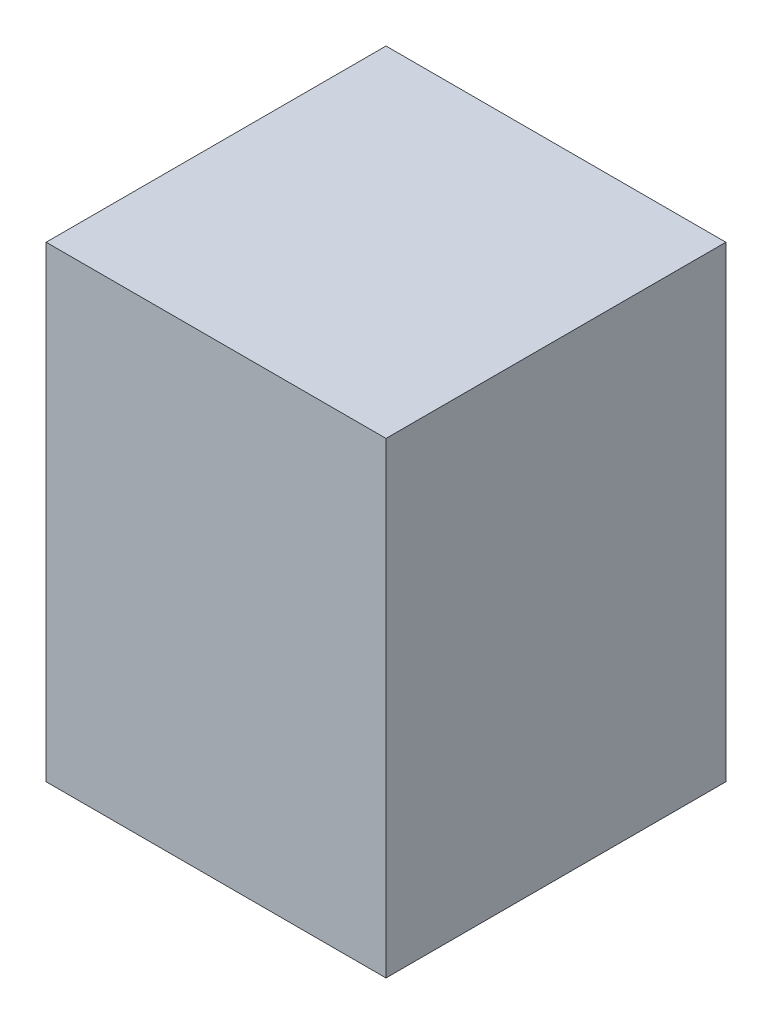
ISO-10303-21;
HEADER;
FILE_DESCRIPTION(('STEP AP214'),'2;1');
FILE_NAME('part.step','',(''),(''),'','','');
FILE_SCHEMA(('AUTOMOTIVE_DESIGN { 1 0 10303 214 1 1 1 1 }'));
ENDSEC;
DATA;
#1=APPLICATION_CONTEXT('core data for automotive mechanical design processes');
#2=APPLICATION_PROTOCOL_DEFINITION('international standard','automotive_design',2000,#1);
#3=PRODUCT_CONTEXT('',#1,'mechanical');
#4=PRODUCT('Part','Part','',(#3));
#5=PRODUCT_RELATED_PRODUCT_CATEGORY('part','',(#4));
#6=PRODUCT_DEFINITION_FORMATION('','',#4);
#7=PRODUCT_DEFINITION_CONTEXT('part definition',#1,'design');
#8=PRODUCT_DEFINITION('design','',#6,#7);
#9=PRODUCT_DEFINITION_SHAPE('','',#8);
#10=(LENGTH_UNIT() NAMED_UNIT(*) SI_UNIT(.MILLI.,.METRE.));
#11=(NAMED_UNIT(*) PLANE_ANGLE_UNIT() SI_UNIT($,.RADIAN.));
#12=(NAMED_UNIT(*) SI_UNIT($,.STERADIAN.) SOLID_ANGLE_UNIT());
#13=UNCERTAINTY_MEASURE_WITH_UNIT(LENGTH_MEASURE(1.E-05),#10,'distance_accuracy_value','');
#14=(GEOMETRIC_REPRESENTATION_CONTEXT(3) GLOBAL_UNCERTAINTY_ASSIGNED_CONTEXT((#13)) GLOBAL_UNIT_ASSIGNED_CONTEXT((#10,
#11,#12)) REPRESENTATION_CONTEXT('',''));
#15=CARTESIAN_POINT('',(0.,0.,0.));
#16=DIRECTION('',(0.,0.,1.));
#17=DIRECTION('',(1.,0.,0.));
#18=AXIS2_PLACEMENT_3D('',#15,#16,#17);
#19=CARTESIAN_POINT('',(0.,0.,800.));
#20=DIRECTION('',(1.,0.,0.));
#21=DIRECTION('',(0.,1.,0.));
#22=AXIS2_PLACEMENT_3D('',#19,#20,#21);
#23=PLANE('',#22);
#24=DIRECTION('',(0.,-1.,0.));
#25=VECTOR('',#24,1.);
#26=CARTESIAN_POINT('',(0.,0.,0.));
#27=LINE('',#26,#25);
#28=CARTESIAN_POINT('',(-1.11022302462516E-13,1100.,0.));
#29=VERTEX_POINT('',#28);
#30=CARTESIAN_POINT('',(0.,0.,0.));
#31=VERTEX_POINT('',#30);
#32=EDGE_CURVE('E100',#29,#31,#27,.T.);
#33=ORIENTED_EDGE('',*,*,#32,.T.);
#34=DIRECTION('',(0.,0.,-1.));
#35=VECTOR('',#34,1.);
#36=CARTESIAN_POINT('',(0.,0.,800.));
#37=LINE('',#36,#35);
#38=CARTESIAN_POINT('',(0.,0.,800.));
#39=VERTEX_POINT('',#38);
#40=EDGE_CURVE('E11',#39,#31,#37,.T.);
#41=ORIENTED_EDGE('',*,*,#40,.F.);
#42=DIRECTION('',(0.,-1.,0.));
#43=VECTOR('',#42,1.);
#44=CARTESIAN_POINT('',(0.,0.,800.));
#45=LINE('',#44,#43);
#46=CARTESIAN_POINT('',(-1.11022302462516E-13,1100.,800.));
#47=VERTEX_POINT('',#46);
#48=EDGE_CURVE('E88',#47,#39,#45,.T.);
#49=ORIENTED_EDGE('',*,*,#48,.F.);
#50=DIRECTION('',(0.,0.,-1.));
#51=VECTOR('',#50,1.);
#52=CARTESIAN_POINT('',(-1.11022302462516E-13,1100.,800.));
#53=LINE('',#52,#51);
#54=EDGE_CURVE('E96',#47,#29,#53,.T.);
#55=ORIENTED_EDGE('',*,*,#54,.T.);
#56=EDGE_LOOP('',(#33,#41,#49,#55));
#57=FACE_BOUND('',#56,.T.);
#58=ADVANCED_FACE('F37',(#57),#23,.F.);
#59=CARTESIAN_POINT('',(0.,0.,800.));
#60=DIRECTION('',(0.,1.,0.));
#61=DIRECTION('',(0.,0.,1.));
#62=AXIS2_PLACEMENT_3D('',#59,#60,#61);
#63=PLANE('',#62);
#64=DIRECTION('',(1.,0.,0.));
#65=VECTOR('',#64,1.);
#66=CARTESIAN_POINT('',(0.,0.,0.));
#67=LINE('',#66,#65);
#68=CARTESIAN_POINT('',(800.,0.,0.));
#69=VERTEX_POINT('',#68);
#70=EDGE_CURVE('E92',#31,#69,#67,.T.);
#71=ORIENTED_EDGE('',*,*,#70,.T.);
#72=DIRECTION('',(0.,0.,-1.));
#73=VECTOR('',#72,1.);
#74=CARTESIAN_POINT('',(800.,0.,800.));
#75=LINE('',#74,#73);
#76=CARTESIAN_POINT('',(800.,0.,800.));
#77=VERTEX_POINT('',#76);
#78=EDGE_CURVE('E45',#77,#69,#75,.T.);
#79=ORIENTED_EDGE('',*,*,#78,.F.);
#80=DIRECTION('',(1.,0.,0.));
#81=VECTOR('',#80,1.);
#82=CARTESIAN_POINT('',(0.,0.,800.));
#83=LINE('',#82,#81);
#84=EDGE_CURVE('E83',#39,#77,#83,.T.);
#85=ORIENTED_EDGE('',*,*,#84,.F.);
#86=ORIENTED_EDGE('',*,*,#40,.T.);
#87=EDGE_LOOP('',(#71,#79,#85,#86));
#88=FACE_BOUND('',#87,.T.);
#89=ADVANCED_FACE('F91',(#88),#63,.F.);
#90=CARTESIAN_POINT('',(800.,0.,800.));
#91=DIRECTION('',(-1.,0.,0.));
#92=DIRECTION('',(0.,-1.,0.));
#93=AXIS2_PLACEMENT_3D('',#90,#91,#92);
#94=PLANE('',#93);
#95=DIRECTION('',(0.,1.,0.));
#96=VECTOR('',#95,1.);
#97=CARTESIAN_POINT('',(800.,0.,0.));
#98=LINE('',#97,#96);
#99=CARTESIAN_POINT('',(800.,1100.,0.));
#100=VERTEX_POINT('',#99);
#101=EDGE_CURVE('E70',#69,#100,#98,.T.);
#102=ORIENTED_EDGE('',*,*,#101,.T.);
#103=DIRECTION('',(0.,0.,-1.));
#104=VECTOR('',#103,1.);
#105=CARTESIAN_POINT('',(800.,1100.,800.));
#106=LINE('',#105,#104);
#107=CARTESIAN_POINT('',(800.,1100.,800.));
#108=VERTEX_POINT('',#107);
#109=EDGE_CURVE('E93',#108,#100,#106,.T.);
#110=ORIENTED_EDGE('',*,*,#109,.F.);
#111=DIRECTION('',(0.,1.,0.));
#112=VECTOR('',#111,1.);
#113=CARTESIAN_POINT('',(800.,0.,800.));
#114=LINE('',#113,#112);
#115=EDGE_CURVE('E86',#77,#108,#114,.T.);
#116=ORIENTED_EDGE('',*,*,#115,.F.);
#117=ORIENTED_EDGE('',*,*,#78,.T.);
#118=EDGE_LOOP('',(#102,#110,#116,#117));
#119=FACE_BOUND('',#118,.T.);
#120=ADVANCED_FACE('F94',(#119),#94,.F.);
#121=CARTESIAN_POINT('',(-1.11022302462516E-13,1100.,800.));
#122=DIRECTION('',(0.,-1.,0.));
#123=DIRECTION('',(0.,0.,-1.));
#124=AXIS2_PLACEMENT_3D('',#121,#122,#123);
#125=PLANE('',#124);
#126=DIRECTION('',(-1.,0.,0.));
#127=VECTOR('',#126,1.);
#128=CARTESIAN_POINT('',(-1.11022302462516E-13,1100.,0.));
#129=LINE('',#128,#127);
#130=EDGE_CURVE('E76',#100,#29,#129,.T.);
#131=ORIENTED_EDGE('',*,*,#130,.T.);
#132=ORIENTED_EDGE('',*,*,#54,.F.);
#133=DIRECTION('',(-1.,0.,0.));
#134=VECTOR('',#133,1.);
#135=CARTESIAN_POINT('',(-1.11022302462516E-13,1100.,800.));
#136=LINE('',#135,#134);
#137=EDGE_CURVE('E53',#108,#47,#136,.T.);
#138=ORIENTED_EDGE('',*,*,#137,.F.);
#139=ORIENTED_EDGE('',*,*,#109,.T.);
#140=EDGE_LOOP('',(#131,#132,#138,#139));
#141=FACE_BOUND('',#140,.T.);
#142=ADVANCED_FACE('F107',(#141),#125,.F.);
#143=CARTESIAN_POINT('',(0.,0.,800.));
#144=DIRECTION('',(0.,0.,-1.));
#145=DIRECTION('',(-1.,0.,0.));
#146=AXIS2_PLACEMENT_3D('',#143,#144,#145);
#147=PLANE('',#146);
#148=ORIENTED_EDGE('',*,*,#48,.T.);
#149=ORIENTED_EDGE('',*,*,#84,.T.);
#150=ORIENTED_EDGE('',*,*,#115,.T.);
#151=ORIENTED_EDGE('',*,*,#137,.T.);
#152=EDGE_LOOP('',(#148,#149,#150,#151));
#153=FACE_BOUND('',#152,.T.);
#154=ADVANCED_FACE('F84',(#153),#147,.F.);
#155=CARTESIAN_POINT('',(0.,0.,0.));
#156=DIRECTION('',(0.,0.,-1.));
#157=DIRECTION('',(-1.,0.,0.));
#158=AXIS2_PLACEMENT_3D('',#155,#156,#157);
#159=PLANE('',#158);
#160=ORIENTED_EDGE('',*,*,#32,.F.);
#161=ORIENTED_EDGE('',*,*,#130,.F.);
#162=ORIENTED_EDGE('',*,*,#101,.F.);
#163=ORIENTED_EDGE('',*,*,#70,.F.);
#164=EDGE_LOOP('',(#160,#161,#162,#163));
#165=FACE_BOUND('',#164,.T.);
#166=ADVANCED_FACE('F110',(#165),#159,.T.);
#167=CLOSED_SHELL('',(#58,#89,#120,#142,#154,#166));
#168=MANIFOLD_SOLID_BREP('B2',#167);
#169=ADVANCED_BREP_SHAPE_REPRESENTATION('',(#18,#168),#14);
#170=SHAPE_DEFINITION_REPRESENTATION(#9,#169);
ENDSEC;
END-ISO-10303-21;
